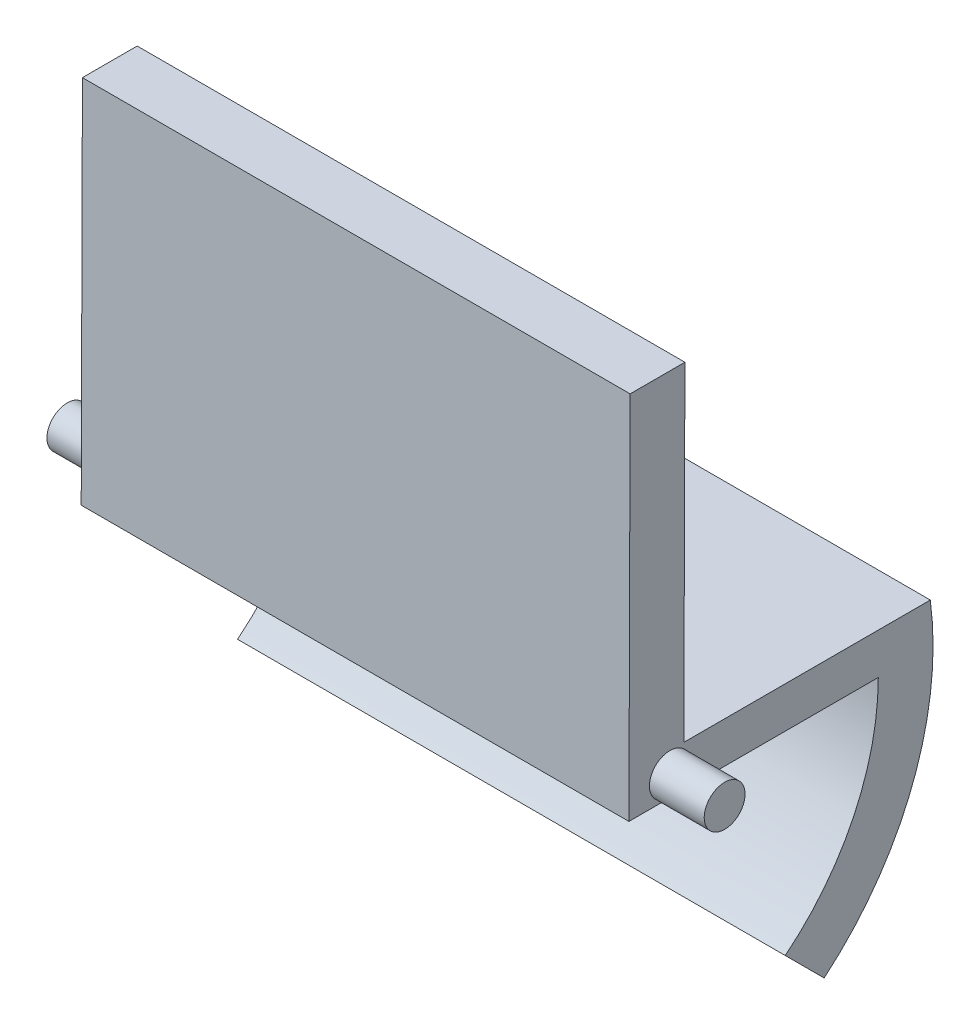
ISO-10303-21;
HEADER;
FILE_DESCRIPTION(('STEP AP214'),'2;1');
FILE_NAME('part.step','',(''),(''),'','','');
FILE_SCHEMA(('AUTOMOTIVE_DESIGN { 1 0 10303 214 1 1 1 1 }'));
ENDSEC;
DATA;
#1=APPLICATION_CONTEXT('core data for automotive mechanical design processes');
#2=APPLICATION_PROTOCOL_DEFINITION('international standard','automotive_design',2000,#1);
#3=PRODUCT_CONTEXT('',#1,'mechanical');
#4=PRODUCT('Part','Part','',(#3));
#5=PRODUCT_RELATED_PRODUCT_CATEGORY('part','',(#4));
#6=PRODUCT_DEFINITION_FORMATION('','',#4);
#7=PRODUCT_DEFINITION_CONTEXT('part definition',#1,'design');
#8=PRODUCT_DEFINITION('design','',#6,#7);
#9=PRODUCT_DEFINITION_SHAPE('','',#8);
#10=(LENGTH_UNIT() NAMED_UNIT(*) SI_UNIT(.MILLI.,.METRE.));
#11=(NAMED_UNIT(*) PLANE_ANGLE_UNIT() SI_UNIT($,.RADIAN.));
#12=(NAMED_UNIT(*) SI_UNIT($,.STERADIAN.) SOLID_ANGLE_UNIT());
#13=UNCERTAINTY_MEASURE_WITH_UNIT(LENGTH_MEASURE(1.E-05),#10,'distance_accuracy_value','');
#14=(GEOMETRIC_REPRESENTATION_CONTEXT(3) GLOBAL_UNCERTAINTY_ASSIGNED_CONTEXT((#13)) GLOBAL_UNIT_ASSIGNED_CONTEXT((#10,
#11,#12)) REPRESENTATION_CONTEXT('',''));
#15=CARTESIAN_POINT('',(0.,0.,0.));
#16=DIRECTION('',(0.,0.,1.));
#17=DIRECTION('',(1.,0.,0.));
#18=AXIS2_PLACEMENT_3D('',#15,#16,#17);
#19=CARTESIAN_POINT('',(100.,60.0382100254973,6.402631946821));
#20=DIRECTION('',(0.,0.00327560321069342,0.999994635197412));
#21=DIRECTION('',(0.,-0.999994635197412,0.00327560321069342));
#22=AXIS2_PLACEMENT_3D('',#19,#20,#21);
#23=PLANE('',#22);
#24=DIRECTION('',(0.,0.999994635197412,-0.00327560321069342));
#25=VECTOR('',#24,1.);
#26=CARTESIAN_POINT('',(0.,60.0382100254973,6.402631946821));
#27=LINE('',#26,#25);
#28=CARTESIAN_POINT('',(0.,0.0382100254972886,6.59916919384614));
#29=VERTEX_POINT('',#28);
#30=CARTESIAN_POINT('',(0.,60.0382100254973,6.402631946821));
#31=VERTEX_POINT('',#30);
#32=EDGE_CURVE('E144',#29,#31,#27,.T.);
#33=ORIENTED_EDGE('',*,*,#32,.T.);
#34=DIRECTION('',(-1.,0.,0.));
#35=VECTOR('',#34,1.);
#36=CARTESIAN_POINT('',(100.,60.0382100254973,6.402631946821));
#37=LINE('',#36,#35);
#38=CARTESIAN_POINT('',(100.,60.0382100254973,6.402631946821));
#39=VERTEX_POINT('',#38);
#40=EDGE_CURVE('E40',#39,#31,#37,.T.);
#41=ORIENTED_EDGE('',*,*,#40,.F.);
#42=DIRECTION('',(0.,0.999994635197412,-0.00327560321069342));
#43=VECTOR('',#42,1.);
#44=CARTESIAN_POINT('',(100.,60.0382100254973,6.402631946821));
#45=LINE('',#44,#43);
#46=CARTESIAN_POINT('',(100.,0.0382100254972886,6.59916919384614));
#47=VERTEX_POINT('',#46);
#48=EDGE_CURVE('E163',#47,#39,#45,.T.);
#49=ORIENTED_EDGE('',*,*,#48,.F.);
#50=DIRECTION('',(-1.,0.,0.));
#51=VECTOR('',#50,1.);
#52=CARTESIAN_POINT('',(100.,0.0382100254972886,6.59916919384614));
#53=LINE('',#52,#51);
#54=EDGE_CURVE('E140',#47,#29,#53,.T.);
#55=ORIENTED_EDGE('',*,*,#54,.T.);
#56=EDGE_LOOP('',(#33,#41,#49,#55));
#57=FACE_BOUND('',#56,.T.);
#58=ADVANCED_FACE('F33',(#57),#23,.F.);
#59=CARTESIAN_POINT('',(100.,60.0382100254973,16.4026855951347));
#60=DIRECTION('',(0.,-1.,0.));
#61=DIRECTION('',(0.,0.,-1.));
#62=AXIS2_PLACEMENT_3D('',#59,#60,#61);
#63=PLANE('',#62);
#64=DIRECTION('',(0.,0.,1.));
#65=VECTOR('',#64,1.);
#66=CARTESIAN_POINT('',(0.,60.0382100254973,16.4026855951347));
#67=LINE('',#66,#65);
#68=CARTESIAN_POINT('',(0.,60.0382100254973,16.4026855951347));
#69=VERTEX_POINT('',#68);
#70=EDGE_CURVE('E147',#31,#69,#67,.T.);
#71=ORIENTED_EDGE('',*,*,#70,.T.);
#72=DIRECTION('',(-1.,0.,0.));
#73=VECTOR('',#72,1.);
#74=CARTESIAN_POINT('',(100.,60.0382100254973,16.4026855951347));
#75=LINE('',#74,#73);
#76=CARTESIAN_POINT('',(100.,60.0382100254973,16.4026855951347));
#77=VERTEX_POINT('',#76);
#78=EDGE_CURVE('E176',#77,#69,#75,.T.);
#79=ORIENTED_EDGE('',*,*,#78,.F.);
#80=DIRECTION('',(0.,0.,1.));
#81=VECTOR('',#80,1.);
#82=CARTESIAN_POINT('',(100.,60.0382100254973,16.4026855951347));
#83=LINE('',#82,#81);
#84=EDGE_CURVE('E98',#39,#77,#83,.T.);
#85=ORIENTED_EDGE('',*,*,#84,.F.);
#86=ORIENTED_EDGE('',*,*,#40,.T.);
#87=EDGE_LOOP('',(#71,#79,#85,#86));
#88=FACE_BOUND('',#87,.T.);
#89=ADVANCED_FACE('F179',(#88),#63,.F.);
#90=CARTESIAN_POINT('',(100.,-7.45927577279908,16.6237817624666));
#91=DIRECTION('',(0.,-0.00327560321069336,-0.999994635197413));
#92=DIRECTION('',(0.,0.999994635197413,-0.00327560321069336));
#93=AXIS2_PLACEMENT_3D('',#90,#91,#92);
#94=PLANE('',#93);
#95=DIRECTION('',(0.,-0.999994635197413,0.00327560321069336));
#96=VECTOR('',#95,1.);
#97=CARTESIAN_POINT('',(0.,-7.45927577279908,16.6237817624666));
#98=LINE('',#97,#96);
#99=CARTESIAN_POINT('',(0.,-7.45927577279908,16.6237817624666));
#100=VERTEX_POINT('',#99);
#101=EDGE_CURVE('E149',#69,#100,#98,.T.);
#102=ORIENTED_EDGE('',*,*,#101,.T.);
#103=DIRECTION('',(-1.,0.,0.));
#104=VECTOR('',#103,1.);
#105=CARTESIAN_POINT('',(100.,-7.45927577279908,16.6237817624666));
#106=LINE('',#105,#104);
#107=CARTESIAN_POINT('',(100.,-7.45927577279908,16.6237817624666));
#108=VERTEX_POINT('',#107);
#109=EDGE_CURVE('E173',#108,#100,#106,.T.);
#110=ORIENTED_EDGE('',*,*,#109,.F.);
#111=DIRECTION('',(0.,-0.999994635197413,0.00327560321069336));
#112=VECTOR('',#111,1.);
#113=CARTESIAN_POINT('',(100.,-7.45927577279908,16.6237817624666));
#114=LINE('',#113,#112);
#115=EDGE_CURVE('E203',#77,#108,#114,.T.);
#116=ORIENTED_EDGE('',*,*,#115,.F.);
#117=ORIENTED_EDGE('',*,*,#78,.T.);
#118=EDGE_LOOP('',(#102,#110,#116,#117));
#119=FACE_BOUND('',#118,.T.);
#120=ADVANCED_FACE('F191',(#119),#94,.F.);
#121=CARTESIAN_POINT('',(100.,-7.45927577279908,16.6237817624666));
#122=DIRECTION('',(0.,1.,0.));
#123=DIRECTION('',(0.,0.,1.));
#124=AXIS2_PLACEMENT_3D('',#121,#122,#123);
#125=PLANE('',#124);
#126=DIRECTION('',(0.,0.,-1.));
#127=VECTOR('',#126,1.);
#128=CARTESIAN_POINT('',(100.,-7.45927577279908,16.6237817624666));
#129=LINE('',#128,#127);
#130=CARTESIAN_POINT('',(100.,-7.45927577279908,9.15152367530122));
#131=VERTEX_POINT('',#130);
#132=CARTESIAN_POINT('',(100.,-7.45927577279907,-28.9041281872285));
#133=VERTEX_POINT('',#132);
#134=EDGE_CURVE('E199',#131,#133,#129,.T.);
#135=ORIENTED_EDGE('',*,*,#134,.F.);
#136=EDGE_CURVE('E197',#108,#131,#129,.T.);
#137=ORIENTED_EDGE('',*,*,#136,.F.);
#138=ORIENTED_EDGE('',*,*,#109,.T.);
#139=DIRECTION('',(0.,0.,-1.));
#140=VECTOR('',#139,1.);
#141=CARTESIAN_POINT('',(0.,-7.45927577279908,16.6237817624666));
#142=LINE('',#141,#140);
#143=CARTESIAN_POINT('',(0.,-7.45927577279908,9.15152367530122));
#144=VERTEX_POINT('',#143);
#145=EDGE_CURVE('E152',#100,#144,#142,.T.);
#146=ORIENTED_EDGE('',*,*,#145,.T.);
#147=CARTESIAN_POINT('',(0.,-7.45927577279907,-28.9041281872285));
#148=VERTEX_POINT('',#147);
#149=EDGE_CURVE('E151',#144,#148,#142,.T.);
#150=ORIENTED_EDGE('',*,*,#149,.T.);
#151=DIRECTION('',(-1.,0.,0.));
#152=VECTOR('',#151,1.);
#153=CARTESIAN_POINT('',(100.,-7.45927577279907,-28.9041281872285));
#154=LINE('',#153,#152);
#155=EDGE_CURVE('E170',#133,#148,#154,.T.);
#156=ORIENTED_EDGE('',*,*,#155,.F.);
#157=EDGE_LOOP('',(#135,#137,#138,#146,#150,#156));
#158=FACE_BOUND('',#157,.T.);
#159=ADVANCED_FACE('F196',(#158),#125,.F.);
#160=CARTESIAN_POINT('',(100.,-7.45927577279908,16.6237817624666));
#161=DIRECTION('',(-1.,0.,0.));
#162=DIRECTION('',(0.,0.,1.));
#163=AXIS2_PLACEMENT_3D('',#160,#161,#162);
#164=CYLINDRICAL_SURFACE('',#163,45.5279099496952);
#165=CARTESIAN_POINT('',(0.,-7.45927577279908,16.6237817624666));
#166=DIRECTION('',(-1.,0.,0.));
#167=DIRECTION('',(0.,0.,1.));
#168=AXIS2_PLACEMENT_3D('',#165,#166,#167);
#169=CIRCLE('',#168,45.5279099496952);
#170=CARTESIAN_POINT('',(0.,-42.9312069605777,-11.9162371968306));
#171=VERTEX_POINT('',#170);
#172=EDGE_CURVE('E155',#148,#171,#169,.T.);
#173=ORIENTED_EDGE('',*,*,#172,.T.);
#174=DIRECTION('',(-1.,0.,0.));
#175=VECTOR('',#174,1.);
#176=CARTESIAN_POINT('',(100.,-42.9312069605777,-11.9162371968306));
#177=LINE('',#176,#175);
#178=CARTESIAN_POINT('',(100.,-42.9312069605777,-11.9162371968306));
#179=VERTEX_POINT('',#178);
#180=EDGE_CURVE('E167',#179,#171,#177,.T.);
#181=ORIENTED_EDGE('',*,*,#180,.F.);
#182=CARTESIAN_POINT('',(100.,-7.45927577279908,16.6237817624666));
#183=DIRECTION('',(-1.,0.,0.));
#184=DIRECTION('',(0.,0.,1.));
#185=AXIS2_PLACEMENT_3D('',#182,#183,#184);
#186=CIRCLE('',#185,45.5279099496952);
#187=EDGE_CURVE('E200',#133,#179,#186,.T.);
#188=ORIENTED_EDGE('',*,*,#187,.F.);
#189=ORIENTED_EDGE('',*,*,#155,.T.);
#190=EDGE_LOOP('',(#173,#181,#188,#189));
#191=FACE_BOUND('',#190,.T.);
#192=ADVANCED_FACE('F243',(#191),#164,.F.);
#193=CARTESIAN_POINT('',(100.,-42.9312069605777,-11.9162371968306));
#194=DIRECTION('',(0.,0.707106781186548,-0.707106781186548));
#195=DIRECTION('',(0.,0.707106781186548,0.707106781186548));
#196=AXIS2_PLACEMENT_3D('',#193,#194,#195);
#197=PLANE('',#196);
#198=DIRECTION('',(0.,-0.707106781186548,-0.707106781186548));
#199=VECTOR('',#198,1.);
#200=CARTESIAN_POINT('',(0.,-42.9312069605777,-11.9162371968306));
#201=LINE('',#200,#199);
#202=CARTESIAN_POINT('',(0.,-50.0361196282415,-19.0211498644944));
#203=VERTEX_POINT('',#202);
#204=EDGE_CURVE('E157',#171,#203,#201,.T.);
#205=ORIENTED_EDGE('',*,*,#204,.T.);
#206=DIRECTION('',(-1.,0.,0.));
#207=VECTOR('',#206,1.);
#208=CARTESIAN_POINT('',(100.,-50.0361196282415,-19.0211498644944));
#209=LINE('',#208,#207);
#210=CARTESIAN_POINT('',(100.,-50.0361196282415,-19.0211498644944));
#211=VERTEX_POINT('',#210);
#212=EDGE_CURVE('E135',#211,#203,#209,.T.);
#213=ORIENTED_EDGE('',*,*,#212,.F.);
#214=DIRECTION('',(0.,-0.707106781186548,-0.707106781186548));
#215=VECTOR('',#214,1.);
#216=CARTESIAN_POINT('',(100.,-42.9312069605777,-11.9162371968306));
#217=LINE('',#216,#215);
#218=EDGE_CURVE('E123',#179,#211,#217,.T.);
#219=ORIENTED_EDGE('',*,*,#218,.F.);
#220=ORIENTED_EDGE('',*,*,#180,.T.);
#221=EDGE_LOOP('',(#205,#213,#219,#220));
#222=FACE_BOUND('',#221,.T.);
#223=ADVANCED_FACE('F246',(#222),#197,.F.);
#224=CARTESIAN_POINT('',(100.,-7.45927577279908,16.6237817624666));
#225=DIRECTION('',(-1.,0.,0.));
#226=DIRECTION('',(0.,0.,1.));
#227=AXIS2_PLACEMENT_3D('',#224,#225,#226);
#228=CYLINDRICAL_SURFACE('',#227,55.5279099496952);
#229=CARTESIAN_POINT('',(0.,-7.45927577279908,16.6237817624666));
#230=DIRECTION('',(1.,0.,0.));
#231=DIRECTION('',(0.,0.,1.));
#232=AXIS2_PLACEMENT_3D('',#229,#230,#231);
#233=CIRCLE('',#232,55.5279099496952);
#234=CARTESIAN_POINT('',(0.,0.,-38.4008308061539));
#235=VERTEX_POINT('',#234);
#236=EDGE_CURVE('E132',#203,#235,#233,.T.);
#237=ORIENTED_EDGE('',*,*,#236,.T.);
#238=DIRECTION('',(-1.,0.,0.));
#239=VECTOR('',#238,1.);
#240=CARTESIAN_POINT('',(100.,0.,-38.4008308061539));
#241=LINE('',#240,#239);
#242=CARTESIAN_POINT('',(100.,0.,-38.4008308061539));
#243=VERTEX_POINT('',#242);
#244=EDGE_CURVE('E129',#243,#235,#241,.T.);
#245=ORIENTED_EDGE('',*,*,#244,.F.);
#246=CARTESIAN_POINT('',(100.,-7.45927577279908,16.6237817624666));
#247=DIRECTION('',(1.,0.,0.));
#248=DIRECTION('',(0.,0.,1.));
#249=AXIS2_PLACEMENT_3D('',#246,#247,#248);
#250=CIRCLE('',#249,55.5279099496952);
#251=EDGE_CURVE('E115',#211,#243,#250,.T.);
#252=ORIENTED_EDGE('',*,*,#251,.F.);
#253=ORIENTED_EDGE('',*,*,#212,.T.);
#254=EDGE_LOOP('',(#237,#245,#252,#253));
#255=FACE_BOUND('',#254,.T.);
#256=ADVANCED_FACE('F130',(#255),#228,.T.);
#257=CARTESIAN_POINT('',(100.,0.0382100254972886,-38.4008308061539));
#258=DIRECTION('',(0.,0.,1.));
#259=DIRECTION('',(1.,0.,0.));
#260=AXIS2_PLACEMENT_3D('',#257,#258,#259);
#261=PLANE('',#260);
#262=DIRECTION('',(0.,1.,0.));
#263=VECTOR('',#262,1.);
#264=CARTESIAN_POINT('',(0.,0.0382100254972886,-38.4008308061539));
#265=LINE('',#264,#263);
#266=CARTESIAN_POINT('',(0.,0.0382100254972886,-38.4008308061539));
#267=VERTEX_POINT('',#266);
#268=EDGE_CURVE('E160',#235,#267,#265,.T.);
#269=ORIENTED_EDGE('',*,*,#268,.T.);
#270=DIRECTION('',(-1.,0.,0.));
#271=VECTOR('',#270,1.);
#272=CARTESIAN_POINT('',(100.,0.0382100254972886,-38.4008308061539));
#273=LINE('',#272,#271);
#274=CARTESIAN_POINT('',(100.,0.0382100254972886,-38.4008308061539));
#275=VERTEX_POINT('',#274);
#276=EDGE_CURVE('E136',#275,#267,#273,.T.);
#277=ORIENTED_EDGE('',*,*,#276,.F.);
#278=DIRECTION('',(0.,1.,0.));
#279=VECTOR('',#278,1.);
#280=CARTESIAN_POINT('',(100.,0.0382100254972886,-38.4008308061539));
#281=LINE('',#280,#279);
#282=EDGE_CURVE('E120',#243,#275,#281,.T.);
#283=ORIENTED_EDGE('',*,*,#282,.F.);
#284=ORIENTED_EDGE('',*,*,#244,.T.);
#285=EDGE_LOOP('',(#269,#277,#283,#284));
#286=FACE_BOUND('',#285,.T.);
#287=ADVANCED_FACE('F138',(#286),#261,.F.);
#288=CARTESIAN_POINT('',(100.,0.0382100254972886,6.59916919384614));
#289=DIRECTION('',(0.,-1.,0.));
#290=DIRECTION('',(0.,0.,-1.));
#291=AXIS2_PLACEMENT_3D('',#288,#289,#290);
#292=PLANE('',#291);
#293=DIRECTION('',(0.,0.,1.));
#294=VECTOR('',#293,1.);
#295=CARTESIAN_POINT('',(0.,0.0382100254972886,6.59916919384614));
#296=LINE('',#295,#294);
#297=EDGE_CURVE('E89',#267,#29,#296,.T.);
#298=ORIENTED_EDGE('',*,*,#297,.T.);
#299=ORIENTED_EDGE('',*,*,#54,.F.);
#300=DIRECTION('',(0.,0.,1.));
#301=VECTOR('',#300,1.);
#302=CARTESIAN_POINT('',(100.,0.0382100254972886,6.59916919384614));
#303=LINE('',#302,#301);
#304=EDGE_CURVE('E53',#275,#47,#303,.T.);
#305=ORIENTED_EDGE('',*,*,#304,.F.);
#306=ORIENTED_EDGE('',*,*,#276,.T.);
#307=EDGE_LOOP('',(#298,#299,#305,#306));
#308=FACE_BOUND('',#307,.T.);
#309=ADVANCED_FACE('F255',(#308),#292,.F.);
#310=CARTESIAN_POINT('',(100.,-7.45927577279908,16.6237817624666));
#311=DIRECTION('',(-1.,0.,0.));
#312=DIRECTION('',(0.,0.,1.));
#313=AXIS2_PLACEMENT_3D('',#310,#311,#312);
#314=PLANE('',#313);
#315=ORIENTED_EDGE('',*,*,#136,.T.);
#316=CARTESIAN_POINT('',(100.,-3.72927577279908,9.15152367530122));
#317=DIRECTION('',(-1.,0.,0.));
#318=DIRECTION('',(0.,0.,1.));
#319=AXIS2_PLACEMENT_3D('',#316,#317,#318);
#320=CIRCLE('',#319,3.73);
#321=EDGE_CURVE('E45',#131,#131,#320,.T.);
#322=ORIENTED_EDGE('',*,*,#321,.T.);
#323=ORIENTED_EDGE('',*,*,#134,.T.);
#324=ORIENTED_EDGE('',*,*,#187,.T.);
#325=ORIENTED_EDGE('',*,*,#218,.T.);
#326=ORIENTED_EDGE('',*,*,#251,.T.);
#327=ORIENTED_EDGE('',*,*,#282,.T.);
#328=ORIENTED_EDGE('',*,*,#304,.T.);
#329=ORIENTED_EDGE('',*,*,#48,.T.);
#330=ORIENTED_EDGE('',*,*,#84,.T.);
#331=ORIENTED_EDGE('',*,*,#115,.T.);
#332=EDGE_LOOP('',(#315,#322,#323,#324,#325,#326,#327,#328,#329,#330,#331));
#333=FACE_BOUND('',#332,.T.);
#334=ADVANCED_FACE('F118',(#333),#314,.F.);
#335=CARTESIAN_POINT('',(0.,-7.45927577279908,16.6237817624666));
#336=DIRECTION('',(-1.,0.,0.));
#337=DIRECTION('',(0.,0.,1.));
#338=AXIS2_PLACEMENT_3D('',#335,#336,#337);
#339=PLANE('',#338);
#340=ORIENTED_EDGE('',*,*,#149,.F.);
#341=CARTESIAN_POINT('',(0.,-3.72927577279908,9.15152367530122));
#342=DIRECTION('',(-1.,0.,0.));
#343=DIRECTION('',(0.,0.,1.));
#344=AXIS2_PLACEMENT_3D('',#341,#342,#343);
#345=CIRCLE('',#344,3.73);
#346=EDGE_CURVE('E11',#144,#144,#345,.T.);
#347=ORIENTED_EDGE('',*,*,#346,.F.);
#348=ORIENTED_EDGE('',*,*,#145,.F.);
#349=ORIENTED_EDGE('',*,*,#101,.F.);
#350=ORIENTED_EDGE('',*,*,#70,.F.);
#351=ORIENTED_EDGE('',*,*,#32,.F.);
#352=ORIENTED_EDGE('',*,*,#297,.F.);
#353=ORIENTED_EDGE('',*,*,#268,.F.);
#354=ORIENTED_EDGE('',*,*,#236,.F.);
#355=ORIENTED_EDGE('',*,*,#204,.F.);
#356=ORIENTED_EDGE('',*,*,#172,.F.);
#357=EDGE_LOOP('',(#340,#347,#348,#349,#350,#351,#352,#353,#354,#355,#356));
#358=FACE_BOUND('',#357,.T.);
#359=ADVANCED_FACE('F185',(#358),#339,.T.);
#360=CARTESIAN_POINT('',(-10.,-3.72927577279908,9.15152367530122));
#361=DIRECTION('',(-1.,0.,0.));
#362=DIRECTION('',(0.,0.,1.));
#363=AXIS2_PLACEMENT_3D('',#360,#361,#362);
#364=PLANE('',#363);
#365=CARTESIAN_POINT('',(-10.,-3.72927577279908,9.15152367530122));
#366=DIRECTION('',(-1.,0.,0.));
#367=DIRECTION('',(0.,0.,1.));
#368=AXIS2_PLACEMENT_3D('',#365,#366,#367);
#369=CIRCLE('',#368,3.73);
#370=CARTESIAN_POINT('',(-10.,-3.72927577279908,12.8815236753012));
#371=VERTEX_POINT('',#370);
#372=EDGE_CURVE('E212',#371,#371,#369,.T.);
#373=ORIENTED_EDGE('',*,*,#372,.T.);
#374=EDGE_LOOP('',(#373));
#375=FACE_BOUND('',#374,.T.);
#376=ADVANCED_FACE('F216',(#375),#364,.T.);
#377=CARTESIAN_POINT('',(110.,-3.72927577279908,9.15152367530122));
#378=DIRECTION('',(-1.,0.,0.));
#379=DIRECTION('',(0.,0.,1.));
#380=AXIS2_PLACEMENT_3D('',#377,#378,#379);
#381=CYLINDRICAL_SURFACE('',#380,3.73);
#382=ORIENTED_EDGE('',*,*,#346,.T.);
#383=EDGE_LOOP('',(#382));
#384=FACE_BOUND('',#383,.T.);
#385=ORIENTED_EDGE('',*,*,#372,.F.);
#386=EDGE_LOOP('',(#385));
#387=FACE_BOUND('',#386,.T.);
#388=ADVANCED_FACE('F218',(#384,#387),#381,.T.);
#389=CARTESIAN_POINT('',(110.,-3.72927577279908,9.15152367530122));
#390=DIRECTION('',(-1.,0.,0.));
#391=DIRECTION('',(0.,0.,1.));
#392=AXIS2_PLACEMENT_3D('',#389,#390,#391);
#393=CIRCLE('',#392,3.73);
#394=CARTESIAN_POINT('',(110.,-3.72927577279908,12.8815236753012));
#395=VERTEX_POINT('',#394);
#396=EDGE_CURVE('E209',#395,#395,#393,.T.);
#397=ORIENTED_EDGE('',*,*,#396,.T.);
#398=EDGE_LOOP('',(#397));
#399=FACE_BOUND('',#398,.T.);
#400=ORIENTED_EDGE('',*,*,#321,.F.);
#401=EDGE_LOOP('',(#400));
#402=FACE_BOUND('',#401,.T.);
#403=ADVANCED_FACE('F220',(#399,#402),#381,.T.);
#404=CARTESIAN_POINT('',(110.,-3.72927577279908,9.15152367530122));
#405=DIRECTION('',(-1.,0.,0.));
#406=DIRECTION('',(0.,0.,1.));
#407=AXIS2_PLACEMENT_3D('',#404,#405,#406);
#408=PLANE('',#407);
#409=ORIENTED_EDGE('',*,*,#396,.F.);
#410=EDGE_LOOP('',(#409));
#411=FACE_BOUND('',#410,.T.);
#412=ADVANCED_FACE('F227',(#411),#408,.F.);
#413=CLOSED_SHELL('',(#58,#89,#120,#159,#192,#223,#256,#287,#309,#334,#359,#376,#388,#403,#412));
#414=MANIFOLD_SOLID_BREP('B2',#413);
#415=ADVANCED_BREP_SHAPE_REPRESENTATION('',(#18,#414),#14);
#416=SHAPE_DEFINITION_REPRESENTATION(#9,#415);
ENDSEC;
END-ISO-10303-21;
